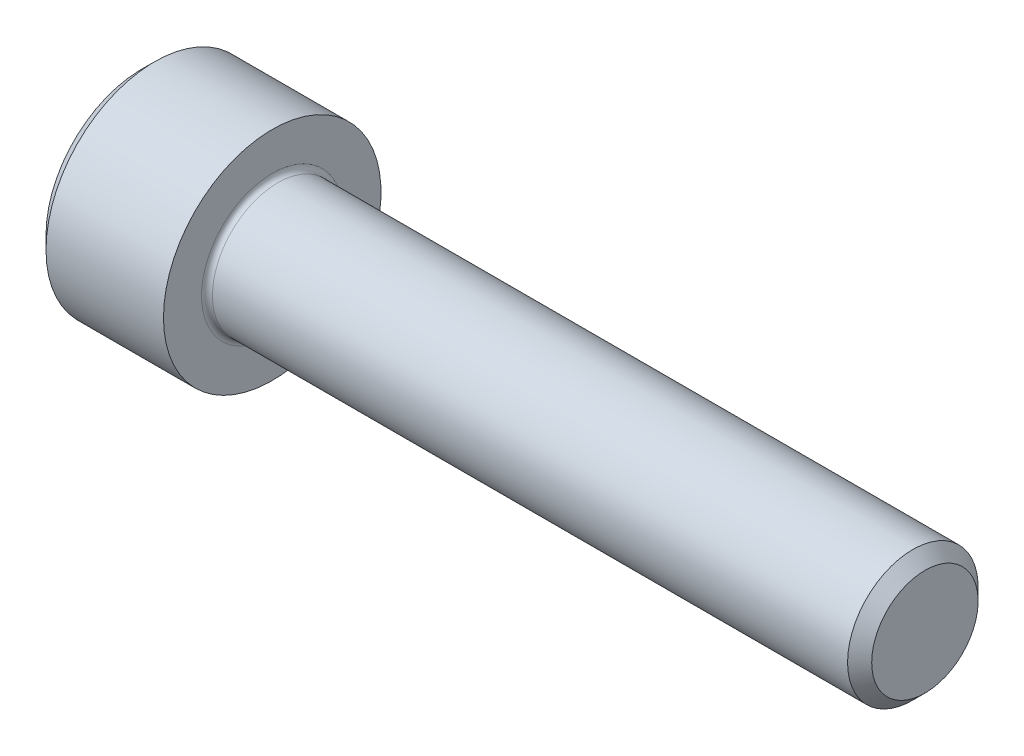
ISO-10303-21;
HEADER;
FILE_DESCRIPTION(('STEP AP214'),'2;1');
FILE_NAME('part.step','',(''),(''),'','','');
FILE_SCHEMA(('AUTOMOTIVE_DESIGN { 1 0 10303 214 1 1 1 1 }'));
ENDSEC;
DATA;
#1=APPLICATION_CONTEXT('core data for automotive mechanical design processes');
#2=APPLICATION_PROTOCOL_DEFINITION('international standard','automotive_design',2000,#1);
#3=PRODUCT_CONTEXT('',#1,'mechanical');
#4=PRODUCT('Part','Part','',(#3));
#5=PRODUCT_RELATED_PRODUCT_CATEGORY('part','',(#4));
#6=PRODUCT_DEFINITION_FORMATION('','',#4);
#7=PRODUCT_DEFINITION_CONTEXT('part definition',#1,'design');
#8=PRODUCT_DEFINITION('design','',#6,#7);
#9=PRODUCT_DEFINITION_SHAPE('','',#8);
#10=(LENGTH_UNIT() NAMED_UNIT(*) SI_UNIT(.MILLI.,.METRE.));
#11=(NAMED_UNIT(*) PLANE_ANGLE_UNIT() SI_UNIT($,.RADIAN.));
#12=(NAMED_UNIT(*) SI_UNIT($,.STERADIAN.) SOLID_ANGLE_UNIT());
#13=UNCERTAINTY_MEASURE_WITH_UNIT(LENGTH_MEASURE(1.E-05),#10,'distance_accuracy_value','');
#14=(GEOMETRIC_REPRESENTATION_CONTEXT(3) GLOBAL_UNCERTAINTY_ASSIGNED_CONTEXT((#13)) GLOBAL_UNIT_ASSIGNED_CONTEXT((#10,
#11,#12)) REPRESENTATION_CONTEXT('',''));
#15=CARTESIAN_POINT('',(0.,0.,0.));
#16=DIRECTION('',(0.,0.,1.));
#17=DIRECTION('',(1.,0.,0.));
#18=AXIS2_PLACEMENT_3D('',#15,#16,#17);
#19=CARTESIAN_POINT('',(0.,0.,0.));
#20=DIRECTION('',(-1.,0.,0.));
#21=DIRECTION('',(0.,0.,1.));
#22=AXIS2_PLACEMENT_3D('',#19,#20,#21);
#23=PLANE('',#22);
#24=DIRECTION('',(0.,-0.5,0.866025403784438));
#25=VECTOR('',#24,1.);
#26=CARTESIAN_POINT('',(0.,2.93524876856006,0.));
#27=LINE('',#26,#25);
#28=CARTESIAN_POINT('',(0.,2.93524876856006,0.));
#29=VERTEX_POINT('',#28);
#30=CARTESIAN_POINT('',(0.,1.46762438428003,2.542));
#31=VERTEX_POINT('',#30);
#32=EDGE_CURVE('E387',#29,#31,#27,.T.);
#33=ORIENTED_EDGE('',*,*,#32,.T.);
#34=DIRECTION('',(0.,1.,0.));
#35=VECTOR('',#34,1.);
#36=CARTESIAN_POINT('',(0.,-1.46762438428003,2.542));
#37=LINE('',#36,#35);
#38=CARTESIAN_POINT('',(0.,-1.46762438428003,2.542));
#39=VERTEX_POINT('',#38);
#40=EDGE_CURVE('E131',#39,#31,#37,.T.);
#41=ORIENTED_EDGE('',*,*,#40,.F.);
#42=DIRECTION('',(0.,-0.500000000000001,-0.866025403784438));
#43=VECTOR('',#42,1.);
#44=CARTESIAN_POINT('',(0.,-1.46762438428003,2.542));
#45=LINE('',#44,#43);
#46=CARTESIAN_POINT('',(0.,-2.93524876856006,0.));
#47=VERTEX_POINT('',#46);
#48=EDGE_CURVE('E390',#39,#47,#45,.T.);
#49=ORIENTED_EDGE('',*,*,#48,.T.);
#50=DIRECTION('',(0.,0.5,-0.866025403784439));
#51=VECTOR('',#50,1.);
#52=CARTESIAN_POINT('',(0.,-2.93524876856006,0.));
#53=LINE('',#52,#51);
#54=CARTESIAN_POINT('',(0.,-1.46762438428003,-2.542));
#55=VERTEX_POINT('',#54);
#56=EDGE_CURVE('E393',#47,#55,#53,.T.);
#57=ORIENTED_EDGE('',*,*,#56,.T.);
#58=DIRECTION('',(0.,-1.,0.));
#59=VECTOR('',#58,1.);
#60=CARTESIAN_POINT('',(0.,1.46762438428002,-2.542));
#61=LINE('',#60,#59);
#62=CARTESIAN_POINT('',(0.,1.46762438428002,-2.542));
#63=VERTEX_POINT('',#62);
#64=EDGE_CURVE('E396',#63,#55,#61,.T.);
#65=ORIENTED_EDGE('',*,*,#64,.F.);
#66=DIRECTION('',(0.,-0.500000000000001,-0.866025403784438));
#67=VECTOR('',#66,1.);
#68=CARTESIAN_POINT('',(0.,2.93524876856006,0.));
#69=LINE('',#68,#67);
#70=EDGE_CURVE('E126',#29,#63,#69,.T.);
#71=ORIENTED_EDGE('',*,*,#70,.F.);
#72=EDGE_LOOP('',(#33,#41,#49,#57,#65,#71));
#73=FACE_BOUND('',#72,.T.);
#74=CARTESIAN_POINT('',(0.,0.,0.));
#75=DIRECTION('',(-1.,0.,0.));
#76=DIRECTION('',(0.,0.,1.));
#77=AXIS2_PLACEMENT_3D('',#74,#75,#76);
#78=CIRCLE('',#77,4.4);
#79=CARTESIAN_POINT('',(0.,0.,4.4));
#80=VERTEX_POINT('',#79);
#81=EDGE_CURVE('E142',#80,#80,#78,.T.);
#82=ORIENTED_EDGE('',*,*,#81,.T.);
#83=EDGE_LOOP('',(#82));
#84=FACE_BOUND('',#83,.T.);
#85=ADVANCED_FACE('F35',(#73,#84),#23,.T.);
#86=CARTESIAN_POINT('',(36.,2.4455,0.));
#87=DIRECTION('',(1.,0.,0.));
#88=DIRECTION('',(0.,0.,-1.));
#89=AXIS2_PLACEMENT_3D('',#86,#87,#88);
#90=PLANE('',#89);
#91=CARTESIAN_POINT('',(36.,0.,0.));
#92=DIRECTION('',(-1.,0.,0.));
#93=DIRECTION('',(0.,0.,1.));
#94=AXIS2_PLACEMENT_3D('',#91,#92,#93);
#95=CIRCLE('',#94,2.4455);
#96=CARTESIAN_POINT('',(36.,0.,2.4455));
#97=VERTEX_POINT('',#96);
#98=EDGE_CURVE('E155',#97,#97,#95,.T.);
#99=ORIENTED_EDGE('',*,*,#98,.F.);
#100=EDGE_LOOP('',(#99));
#101=FACE_BOUND('',#100,.T.);
#102=ADVANCED_FACE('F176',(#101),#90,.T.);
#103=CARTESIAN_POINT('',(36.,0.,0.));
#104=DIRECTION('',(-1.,0.,0.));
#105=DIRECTION('',(0.,0.,1.));
#106=AXIS2_PLACEMENT_3D('',#103,#104,#105);
#107=CONICAL_SURFACE('',#106,2.4455,0.785398163397396);
#108=CARTESIAN_POINT('',(35.4455,0.,0.));
#109=DIRECTION('',(-1.,0.,0.));
#110=DIRECTION('',(0.,0.,1.));
#111=AXIS2_PLACEMENT_3D('',#108,#109,#110);
#112=CIRCLE('',#111,2.99999999999996);
#113=CARTESIAN_POINT('',(35.4455,0.,2.99999999999996));
#114=VERTEX_POINT('',#113);
#115=EDGE_CURVE('E152',#114,#114,#112,.T.);
#116=ORIENTED_EDGE('',*,*,#115,.F.);
#117=EDGE_LOOP('',(#116));
#118=FACE_BOUND('',#117,.T.);
#119=ORIENTED_EDGE('',*,*,#98,.T.);
#120=EDGE_LOOP('',(#119));
#121=FACE_BOUND('',#120,.T.);
#122=ADVANCED_FACE('F182',(#118,#121),#107,.T.);
#123=CARTESIAN_POINT('',(-31.75,0.,0.));
#124=DIRECTION('',(-1.,0.,0.));
#125=DIRECTION('',(0.,0.,1.));
#126=AXIS2_PLACEMENT_3D('',#123,#124,#125);
#127=CYLINDRICAL_SURFACE('',#126,2.99999999999998);
#128=CARTESIAN_POINT('',(6.25,0.,0.));
#129=DIRECTION('',(1.,0.,0.));
#130=DIRECTION('',(0.,0.,-1.));
#131=AXIS2_PLACEMENT_3D('',#128,#129,#130);
#132=CIRCLE('',#131,2.99999999999998);
#133=CARTESIAN_POINT('',(6.25,0.,-2.99999999999998));
#134=VERTEX_POINT('',#133);
#135=EDGE_CURVE('E11',#134,#134,#132,.T.);
#136=ORIENTED_EDGE('',*,*,#135,.T.);
#137=EDGE_LOOP('',(#136));
#138=FACE_BOUND('',#137,.T.);
#139=ORIENTED_EDGE('',*,*,#115,.T.);
#140=EDGE_LOOP('',(#139));
#141=FACE_BOUND('',#140,.T.);
#142=ADVANCED_FACE('F193',(#138,#141),#127,.T.);
#143=CARTESIAN_POINT('',(6.,5.,0.));
#144=DIRECTION('',(1.,0.,0.));
#145=DIRECTION('',(0.,0.,-1.));
#146=AXIS2_PLACEMENT_3D('',#143,#144,#145);
#147=PLANE('',#146);
#148=CARTESIAN_POINT('',(6.,0.,0.));
#149=DIRECTION('',(1.,0.,0.));
#150=DIRECTION('',(0.,0.,-1.));
#151=AXIS2_PLACEMENT_3D('',#148,#149,#150);
#152=CIRCLE('',#151,3.24999999999998);
#153=CARTESIAN_POINT('',(6.,0.,-3.24999999999998));
#154=VERTEX_POINT('',#153);
#155=EDGE_CURVE('E43',#154,#154,#152,.F.);
#156=ORIENTED_EDGE('',*,*,#155,.T.);
#157=EDGE_LOOP('',(#156));
#158=FACE_BOUND('',#157,.T.);
#159=CARTESIAN_POINT('',(6.,0.,0.));
#160=DIRECTION('',(-1.,0.,0.));
#161=DIRECTION('',(0.,0.,1.));
#162=AXIS2_PLACEMENT_3D('',#159,#160,#161);
#163=CIRCLE('',#162,5.);
#164=CARTESIAN_POINT('',(6.,0.,5.));
#165=VERTEX_POINT('',#164);
#166=EDGE_CURVE('E149',#165,#165,#163,.T.);
#167=ORIENTED_EDGE('',*,*,#166,.F.);
#168=EDGE_LOOP('',(#167));
#169=FACE_BOUND('',#168,.T.);
#170=ADVANCED_FACE('F160',(#158,#169),#147,.T.);
#171=CARTESIAN_POINT('',(-31.75,0.,0.));
#172=DIRECTION('',(-1.,0.,0.));
#173=DIRECTION('',(0.,0.,1.));
#174=AXIS2_PLACEMENT_3D('',#171,#172,#173);
#175=CYLINDRICAL_SURFACE('',#174,5.);
#176=ORIENTED_EDGE('',*,*,#166,.T.);
#177=EDGE_LOOP('',(#176));
#178=FACE_BOUND('',#177,.T.);
#179=CARTESIAN_POINT('',(0.600000000000003,0.,0.));
#180=DIRECTION('',(-1.,0.,0.));
#181=DIRECTION('',(0.,0.,1.));
#182=AXIS2_PLACEMENT_3D('',#179,#180,#181);
#183=CIRCLE('',#182,5.);
#184=CARTESIAN_POINT('',(0.600000000000003,0.,5.));
#185=VERTEX_POINT('',#184);
#186=EDGE_CURVE('E146',#185,#185,#183,.T.);
#187=ORIENTED_EDGE('',*,*,#186,.F.);
#188=EDGE_LOOP('',(#187));
#189=FACE_BOUND('',#188,.T.);
#190=ADVANCED_FACE('F171',(#178,#189),#175,.T.);
#191=CARTESIAN_POINT('',(0.,0.,0.));
#192=DIRECTION('',(1.,0.,0.));
#193=DIRECTION('',(0.,0.,-1.));
#194=AXIS2_PLACEMENT_3D('',#191,#192,#193);
#195=CONICAL_SURFACE('',#194,4.4,0.785398163397448);
#196=ORIENTED_EDGE('',*,*,#186,.T.);
#197=EDGE_LOOP('',(#196));
#198=FACE_BOUND('',#197,.T.);
#199=ORIENTED_EDGE('',*,*,#81,.F.);
#200=EDGE_LOOP('',(#199));
#201=FACE_BOUND('',#200,.T.);
#202=ADVANCED_FACE('F164',(#198,#201),#195,.T.);
#203=CARTESIAN_POINT('',(6.25,0.,0.));
#204=DIRECTION('',(1.,0.,0.));
#205=DIRECTION('',(0.,0.,-1.));
#206=AXIS2_PLACEMENT_3D('',#203,#204,#205);
#207=TOROIDAL_SURFACE('',#206,3.24999999999998,0.25);
#208=ORIENTED_EDGE('',*,*,#135,.F.);
#209=EDGE_LOOP('',(#208));
#210=FACE_BOUND('',#209,.T.);
#211=ORIENTED_EDGE('',*,*,#155,.F.);
#212=EDGE_LOOP('',(#211));
#213=FACE_BOUND('',#212,.T.);
#214=ADVANCED_FACE('F37',(#210,#213),#207,.F.);
#215=CARTESIAN_POINT('',(3.,2.93524876856006,0.));
#216=DIRECTION('',(0.,-0.866025403784439,-0.5));
#217=DIRECTION('',(0.,0.5,-0.866025403784439));
#218=AXIS2_PLACEMENT_3D('',#215,#216,#217);
#219=PLANE('',#218);
#220=ORIENTED_EDGE('',*,*,#32,.F.);
#221=DIRECTION('',(-1.,0.,0.));
#222=VECTOR('',#221,1.);
#223=CARTESIAN_POINT('',(3.,2.93524876856006,0.));
#224=LINE('',#223,#222);
#225=CARTESIAN_POINT('',(3.,2.93524876856006,0.));
#226=VERTEX_POINT('',#225);
#227=EDGE_CURVE('E377',#226,#29,#224,.T.);
#228=ORIENTED_EDGE('',*,*,#227,.F.);
#229=DIRECTION('',(0.,-0.5,0.866025403784438));
#230=VECTOR('',#229,1.);
#231=CARTESIAN_POINT('',(3.,2.93524876856006,0.));
#232=LINE('',#231,#230);
#233=CARTESIAN_POINT('',(3.,2.20143657642004,1.271));
#234=VERTEX_POINT('',#233);
#235=EDGE_CURVE('E118',#226,#234,#232,.T.);
#236=ORIENTED_EDGE('',*,*,#235,.T.);
#237=CARTESIAN_POINT('',(3.,1.46762438428003,2.542));
#238=VERTEX_POINT('',#237);
#239=EDGE_CURVE('E109',#234,#238,#232,.T.);
#240=ORIENTED_EDGE('',*,*,#239,.T.);
#241=DIRECTION('',(-1.,0.,0.));
#242=VECTOR('',#241,1.);
#243=CARTESIAN_POINT('',(3.,1.46762438428003,2.542));
#244=LINE('',#243,#242);
#245=EDGE_CURVE('E123',#238,#31,#244,.T.);
#246=ORIENTED_EDGE('',*,*,#245,.T.);
#247=EDGE_LOOP('',(#220,#228,#236,#240,#246));
#248=FACE_BOUND('',#247,.T.);
#249=ADVANCED_FACE('F122',(#248),#219,.T.);
#250=CARTESIAN_POINT('',(3.,-1.46762438428003,2.542));
#251=DIRECTION('',(0.,0.,1.));
#252=DIRECTION('',(0.,-1.,0.));
#253=AXIS2_PLACEMENT_3D('',#250,#251,#252);
#254=PLANE('',#253);
#255=ORIENTED_EDGE('',*,*,#40,.T.);
#256=ORIENTED_EDGE('',*,*,#245,.F.);
#257=DIRECTION('',(0.,1.,0.));
#258=VECTOR('',#257,1.);
#259=CARTESIAN_POINT('',(3.,-1.46762438428003,2.542));
#260=LINE('',#259,#258);
#261=CARTESIAN_POINT('',(3.,0.,2.542));
#262=VERTEX_POINT('',#261);
#263=EDGE_CURVE('E106',#262,#238,#260,.T.);
#264=ORIENTED_EDGE('',*,*,#263,.F.);
#265=CARTESIAN_POINT('',(3.,-1.46762438428003,2.542));
#266=VERTEX_POINT('',#265);
#267=EDGE_CURVE('E117',#266,#262,#260,.T.);
#268=ORIENTED_EDGE('',*,*,#267,.F.);
#269=DIRECTION('',(-1.,0.,0.));
#270=VECTOR('',#269,1.);
#271=CARTESIAN_POINT('',(3.,-1.46762438428003,2.542));
#272=LINE('',#271,#270);
#273=EDGE_CURVE('E133',#266,#39,#272,.T.);
#274=ORIENTED_EDGE('',*,*,#273,.T.);
#275=EDGE_LOOP('',(#255,#256,#264,#268,#274));
#276=FACE_BOUND('',#275,.T.);
#277=ADVANCED_FACE('F128',(#276),#254,.F.);
#278=CARTESIAN_POINT('',(3.,-1.46762438428003,2.542));
#279=DIRECTION('',(0.,0.866025403784438,-0.500000000000001));
#280=DIRECTION('',(0.,0.500000000000001,0.866025403784438));
#281=AXIS2_PLACEMENT_3D('',#278,#279,#280);
#282=PLANE('',#281);
#283=ORIENTED_EDGE('',*,*,#48,.F.);
#284=ORIENTED_EDGE('',*,*,#273,.F.);
#285=DIRECTION('',(0.,-0.500000000000001,-0.866025403784438));
#286=VECTOR('',#285,1.);
#287=CARTESIAN_POINT('',(3.,-1.46762438428003,2.542));
#288=LINE('',#287,#286);
#289=CARTESIAN_POINT('',(3.,-2.20143657642004,1.271));
#290=VERTEX_POINT('',#289);
#291=EDGE_CURVE('E416',#266,#290,#288,.T.);
#292=ORIENTED_EDGE('',*,*,#291,.T.);
#293=CARTESIAN_POINT('',(3.,-2.93524876856006,0.));
#294=VERTEX_POINT('',#293);
#295=EDGE_CURVE('E405',#290,#294,#288,.T.);
#296=ORIENTED_EDGE('',*,*,#295,.T.);
#297=DIRECTION('',(-1.,0.,0.));
#298=VECTOR('',#297,1.);
#299=CARTESIAN_POINT('',(3.,-2.93524876856006,0.));
#300=LINE('',#299,#298);
#301=EDGE_CURVE('E138',#294,#47,#300,.T.);
#302=ORIENTED_EDGE('',*,*,#301,.T.);
#303=EDGE_LOOP('',(#283,#284,#292,#296,#302));
#304=FACE_BOUND('',#303,.T.);
#305=ADVANCED_FACE('F268',(#304),#282,.T.);
#306=CARTESIAN_POINT('',(3.,-2.93524876856006,0.));
#307=DIRECTION('',(0.,0.866025403784439,0.5));
#308=DIRECTION('',(0.,-0.5,0.866025403784439));
#309=AXIS2_PLACEMENT_3D('',#306,#307,#308);
#310=PLANE('',#309);
#311=ORIENTED_EDGE('',*,*,#56,.F.);
#312=ORIENTED_EDGE('',*,*,#301,.F.);
#313=DIRECTION('',(0.,0.5,-0.866025403784439));
#314=VECTOR('',#313,1.);
#315=CARTESIAN_POINT('',(3.,-2.93524876856006,0.));
#316=LINE('',#315,#314);
#317=CARTESIAN_POINT('',(3.,-2.20143657642005,-1.271));
#318=VERTEX_POINT('',#317);
#319=EDGE_CURVE('E383',#294,#318,#316,.T.);
#320=ORIENTED_EDGE('',*,*,#319,.T.);
#321=CARTESIAN_POINT('',(3.,-1.46762438428003,-2.542));
#322=VERTEX_POINT('',#321);
#323=EDGE_CURVE('E415',#318,#322,#316,.T.);
#324=ORIENTED_EDGE('',*,*,#323,.T.);
#325=DIRECTION('',(-1.,0.,0.));
#326=VECTOR('',#325,1.);
#327=CARTESIAN_POINT('',(3.,-1.46762438428003,-2.542));
#328=LINE('',#327,#326);
#329=EDGE_CURVE('E376',#322,#55,#328,.T.);
#330=ORIENTED_EDGE('',*,*,#329,.T.);
#331=EDGE_LOOP('',(#311,#312,#320,#324,#330));
#332=FACE_BOUND('',#331,.T.);
#333=ADVANCED_FACE('F276',(#332),#310,.T.);
#334=CARTESIAN_POINT('',(3.,1.46762438428002,-2.542));
#335=DIRECTION('',(0.,0.,-1.));
#336=DIRECTION('',(0.,1.,0.));
#337=AXIS2_PLACEMENT_3D('',#334,#335,#336);
#338=PLANE('',#337);
#339=ORIENTED_EDGE('',*,*,#64,.T.);
#340=ORIENTED_EDGE('',*,*,#329,.F.);
#341=DIRECTION('',(0.,-1.,0.));
#342=VECTOR('',#341,1.);
#343=CARTESIAN_POINT('',(3.,1.46762438428002,-2.542));
#344=LINE('',#343,#342);
#345=CARTESIAN_POINT('',(3.,0.,-2.542));
#346=VERTEX_POINT('',#345);
#347=EDGE_CURVE('E380',#346,#322,#344,.T.);
#348=ORIENTED_EDGE('',*,*,#347,.F.);
#349=CARTESIAN_POINT('',(3.,1.46762438428002,-2.542));
#350=VERTEX_POINT('',#349);
#351=EDGE_CURVE('E50',#350,#346,#344,.T.);
#352=ORIENTED_EDGE('',*,*,#351,.F.);
#353=DIRECTION('',(-1.,0.,0.));
#354=VECTOR('',#353,1.);
#355=CARTESIAN_POINT('',(3.,1.46762438428002,-2.542));
#356=LINE('',#355,#354);
#357=EDGE_CURVE('E373',#350,#63,#356,.T.);
#358=ORIENTED_EDGE('',*,*,#357,.T.);
#359=EDGE_LOOP('',(#339,#340,#348,#352,#358));
#360=FACE_BOUND('',#359,.T.);
#361=ADVANCED_FACE('F285',(#360),#338,.F.);
#362=CARTESIAN_POINT('',(3.,2.93524876856006,0.));
#363=DIRECTION('',(0.,0.866025403784438,-0.500000000000001));
#364=DIRECTION('',(0.,0.500000000000001,0.866025403784438));
#365=AXIS2_PLACEMENT_3D('',#362,#363,#364);
#366=PLANE('',#365);
#367=ORIENTED_EDGE('',*,*,#70,.T.);
#368=ORIENTED_EDGE('',*,*,#357,.F.);
#369=DIRECTION('',(0.,-0.500000000000001,-0.866025403784438));
#370=VECTOR('',#369,1.);
#371=CARTESIAN_POINT('',(3.,2.93524876856006,0.));
#372=LINE('',#371,#370);
#373=CARTESIAN_POINT('',(3.,2.20143657642004,-1.271));
#374=VERTEX_POINT('',#373);
#375=EDGE_CURVE('E363',#374,#350,#372,.T.);
#376=ORIENTED_EDGE('',*,*,#375,.F.);
#377=EDGE_CURVE('E369',#226,#374,#372,.T.);
#378=ORIENTED_EDGE('',*,*,#377,.F.);
#379=ORIENTED_EDGE('',*,*,#227,.T.);
#380=EDGE_LOOP('',(#367,#368,#376,#378,#379));
#381=FACE_BOUND('',#380,.T.);
#382=ADVANCED_FACE('F294',(#381),#366,.F.);
#383=CARTESIAN_POINT('',(3.,2.93524876856006,0.));
#384=DIRECTION('',(1.,0.,0.));
#385=DIRECTION('',(0.,0.,-1.));
#386=AXIS2_PLACEMENT_3D('',#383,#384,#385);
#387=PLANE('',#386);
#388=ORIENTED_EDGE('',*,*,#347,.T.);
#389=ORIENTED_EDGE('',*,*,#323,.F.);
#390=CARTESIAN_POINT('',(3.,0.,0.));
#391=DIRECTION('',(-1.,0.,0.));
#392=DIRECTION('',(0.,0.,1.));
#393=AXIS2_PLACEMENT_3D('',#390,#391,#392);
#394=CIRCLE('',#393,2.542);
#395=EDGE_CURVE('E411',#346,#318,#394,.T.);
#396=ORIENTED_EDGE('',*,*,#395,.F.);
#397=EDGE_LOOP('',(#388,#389,#396));
#398=FACE_BOUND('',#397,.T.);
#399=ADVANCED_FACE('F303',(#398),#387,.F.);
#400=ORIENTED_EDGE('',*,*,#319,.F.);
#401=ORIENTED_EDGE('',*,*,#295,.F.);
#402=EDGE_CURVE('E136',#318,#290,#394,.T.);
#403=ORIENTED_EDGE('',*,*,#402,.F.);
#404=EDGE_LOOP('',(#400,#401,#403));
#405=FACE_BOUND('',#404,.T.);
#406=ADVANCED_FACE('F312',(#405),#387,.F.);
#407=ORIENTED_EDGE('',*,*,#291,.F.);
#408=ORIENTED_EDGE('',*,*,#267,.T.);
#409=EDGE_CURVE('E132',#290,#262,#394,.T.);
#410=ORIENTED_EDGE('',*,*,#409,.F.);
#411=EDGE_LOOP('',(#407,#408,#410));
#412=FACE_BOUND('',#411,.T.);
#413=ADVANCED_FACE('F321',(#412),#387,.F.);
#414=ORIENTED_EDGE('',*,*,#263,.T.);
#415=ORIENTED_EDGE('',*,*,#239,.F.);
#416=EDGE_CURVE('E112',#262,#234,#394,.T.);
#417=ORIENTED_EDGE('',*,*,#416,.F.);
#418=EDGE_LOOP('',(#414,#415,#417));
#419=FACE_BOUND('',#418,.T.);
#420=ADVANCED_FACE('F108',(#419),#387,.F.);
#421=ORIENTED_EDGE('',*,*,#235,.F.);
#422=ORIENTED_EDGE('',*,*,#377,.T.);
#423=EDGE_CURVE('E143',#234,#374,#394,.T.);
#424=ORIENTED_EDGE('',*,*,#423,.F.);
#425=EDGE_LOOP('',(#421,#422,#424));
#426=FACE_BOUND('',#425,.T.);
#427=ADVANCED_FACE('F336',(#426),#387,.F.);
#428=ORIENTED_EDGE('',*,*,#375,.T.);
#429=ORIENTED_EDGE('',*,*,#351,.T.);
#430=EDGE_CURVE('E366',#374,#346,#394,.T.);
#431=ORIENTED_EDGE('',*,*,#430,.F.);
#432=EDGE_LOOP('',(#428,#429,#431));
#433=FACE_BOUND('',#432,.T.);
#434=ADVANCED_FACE('F251',(#433),#387,.F.);
#435=CARTESIAN_POINT('',(3.,0.,0.));
#436=DIRECTION('',(-1.,0.,0.));
#437=DIRECTION('',(0.,0.,1.));
#438=AXIS2_PLACEMENT_3D('',#435,#436,#437);
#439=CONICAL_SURFACE('',#438,2.542,1.04719755119659);
#440=CARTESIAN_POINT('',(4.46762438428004,0.,0.));
#441=VERTEX_POINT('',#440);
#442=VERTEX_LOOP('',#441);
#443=FACE_BOUND('',#442,.T.);
#444=ORIENTED_EDGE('',*,*,#416,.T.);
#445=ORIENTED_EDGE('',*,*,#423,.T.);
#446=ORIENTED_EDGE('',*,*,#430,.T.);
#447=ORIENTED_EDGE('',*,*,#395,.T.);
#448=ORIENTED_EDGE('',*,*,#402,.T.);
#449=ORIENTED_EDGE('',*,*,#409,.T.);
#450=EDGE_LOOP('',(#444,#445,#446,#447,#448,#449));
#451=FACE_BOUND('',#450,.T.);
#452=ADVANCED_FACE('F186',(#443,#451),#439,.F.);
#453=CLOSED_SHELL('',(#85,#102,#122,#142,#170,#190,#202,#214,#249,#277,#305,#333,#361,#382,#399,
#406,#413,#420,#427,#434,#452));
#454=MANIFOLD_SOLID_BREP('B2',#453);
#455=ADVANCED_BREP_SHAPE_REPRESENTATION('',(#18,#454),#14);
#456=SHAPE_DEFINITION_REPRESENTATION(#9,#455);
ENDSEC;
END-ISO-10303-21;
